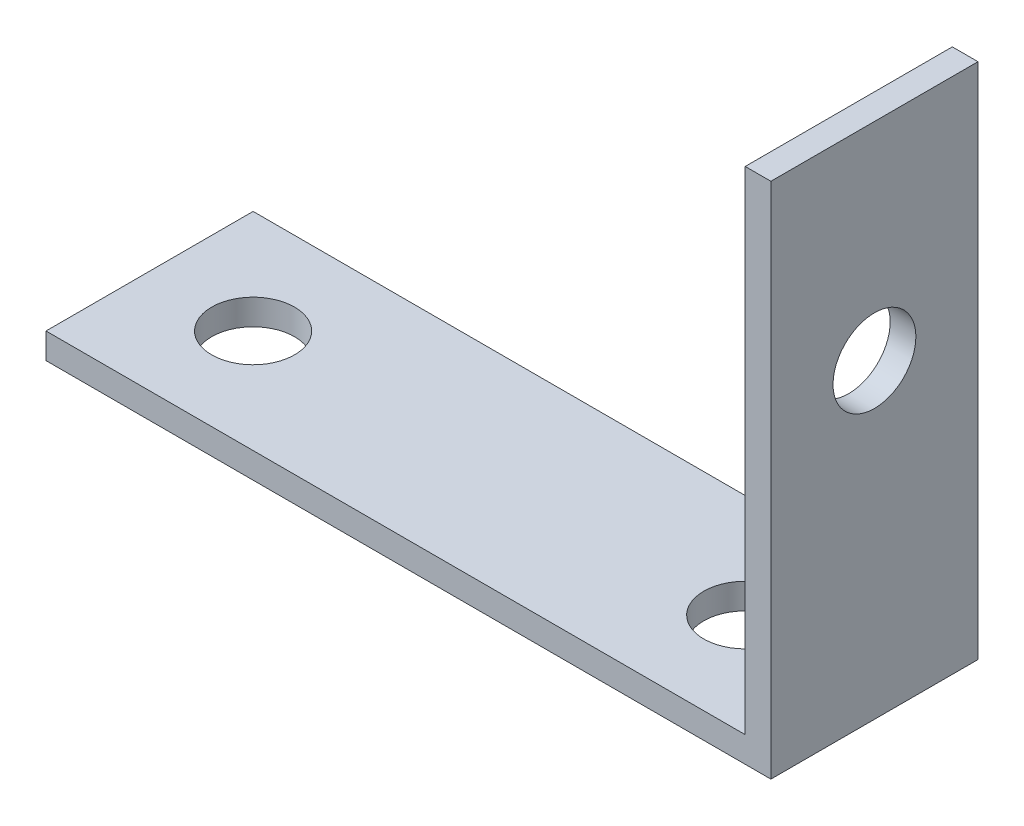
ISO-10303-21;
HEADER;
FILE_DESCRIPTION(('STEP AP214'),'2;1');
FILE_NAME('part.step','',(''),(''),'','','');
FILE_SCHEMA(('AUTOMOTIVE_DESIGN { 1 0 10303 214 1 1 1 1 }'));
ENDSEC;
DATA;
#1=APPLICATION_CONTEXT('core data for automotive mechanical design processes');
#2=APPLICATION_PROTOCOL_DEFINITION('international standard','automotive_design',2000,#1);
#3=PRODUCT_CONTEXT('',#1,'mechanical');
#4=PRODUCT('Part','Part','',(#3));
#5=PRODUCT_RELATED_PRODUCT_CATEGORY('part','',(#4));
#6=PRODUCT_DEFINITION_FORMATION('','',#4);
#7=PRODUCT_DEFINITION_CONTEXT('part definition',#1,'design');
#8=PRODUCT_DEFINITION('design','',#6,#7);
#9=PRODUCT_DEFINITION_SHAPE('','',#8);
#10=(LENGTH_UNIT() NAMED_UNIT(*) SI_UNIT(.MILLI.,.METRE.));
#11=(NAMED_UNIT(*) PLANE_ANGLE_UNIT() SI_UNIT($,.RADIAN.));
#12=(NAMED_UNIT(*) SI_UNIT($,.STERADIAN.) SOLID_ANGLE_UNIT());
#13=UNCERTAINTY_MEASURE_WITH_UNIT(LENGTH_MEASURE(1.E-05),#10,'distance_accuracy_value','');
#14=(GEOMETRIC_REPRESENTATION_CONTEXT(3) GLOBAL_UNCERTAINTY_ASSIGNED_CONTEXT((#13)) GLOBAL_UNIT_ASSIGNED_CONTEXT((#10,
#11,#12)) REPRESENTATION_CONTEXT('',''));
#15=CARTESIAN_POINT('',(0.,0.,0.));
#16=DIRECTION('',(0.,0.,1.));
#17=DIRECTION('',(1.,0.,0.));
#18=AXIS2_PLACEMENT_3D('',#15,#16,#17);
#19=CARTESIAN_POINT('',(0.,1.5748,12.7));
#20=DIRECTION('',(1.,0.,0.));
#21=DIRECTION('',(0.,1.,0.));
#22=AXIS2_PLACEMENT_3D('',#19,#20,#21);
#23=PLANE('',#22);
#24=DIRECTION('',(0.,-1.,0.));
#25=VECTOR('',#24,1.);
#26=CARTESIAN_POINT('',(0.,1.5748,0.));
#27=LINE('',#26,#25);
#28=CARTESIAN_POINT('',(0.,1.5748,0.));
#29=VERTEX_POINT('',#28);
#30=CARTESIAN_POINT('',(0.,0.,0.));
#31=VERTEX_POINT('',#30);
#32=EDGE_CURVE('E116',#29,#31,#27,.T.);
#33=ORIENTED_EDGE('',*,*,#32,.T.);
#34=DIRECTION('',(0.,0.,-1.));
#35=VECTOR('',#34,1.);
#36=CARTESIAN_POINT('',(0.,0.,12.7));
#37=LINE('',#36,#35);
#38=CARTESIAN_POINT('',(0.,0.,12.7));
#39=VERTEX_POINT('',#38);
#40=EDGE_CURVE('E11',#39,#31,#37,.T.);
#41=ORIENTED_EDGE('',*,*,#40,.F.);
#42=DIRECTION('',(0.,-1.,0.));
#43=VECTOR('',#42,1.);
#44=CARTESIAN_POINT('',(0.,1.5748,12.7));
#45=LINE('',#44,#43);
#46=CARTESIAN_POINT('',(0.,1.5748,12.7));
#47=VERTEX_POINT('',#46);
#48=EDGE_CURVE('E127',#47,#39,#45,.T.);
#49=ORIENTED_EDGE('',*,*,#48,.F.);
#50=DIRECTION('',(0.,0.,-1.));
#51=VECTOR('',#50,1.);
#52=CARTESIAN_POINT('',(0.,1.5748,12.7));
#53=LINE('',#52,#51);
#54=EDGE_CURVE('E112',#47,#29,#53,.T.);
#55=ORIENTED_EDGE('',*,*,#54,.T.);
#56=EDGE_LOOP('',(#33,#41,#49,#55));
#57=FACE_BOUND('',#56,.T.);
#58=ADVANCED_FACE('F32',(#57),#23,.F.);
#59=CARTESIAN_POINT('',(0.,0.,12.7));
#60=DIRECTION('',(0.,1.,0.));
#61=DIRECTION('',(0.,0.,1.));
#62=AXIS2_PLACEMENT_3D('',#59,#60,#61);
#63=PLANE('',#62);
#64=CARTESIAN_POINT('',(6.35,0.,6.35));
#65=DIRECTION('',(0.,1.,0.));
#66=DIRECTION('',(-1.,0.,0.));
#67=AXIS2_PLACEMENT_3D('',#64,#65,#66);
#68=CIRCLE('',#67,2.54);
#69=CARTESIAN_POINT('',(3.81,0.,6.35));
#70=VERTEX_POINT('',#69);
#71=EDGE_CURVE('E237',#70,#70,#68,.T.);
#72=ORIENTED_EDGE('',*,*,#71,.T.);
#73=EDGE_LOOP('',(#72));
#74=FACE_BOUND('',#73,.T.);
#75=CARTESIAN_POINT('',(36.5252,0.,6.35));
#76=DIRECTION('',(0.,1.,0.));
#77=DIRECTION('',(-1.,0.,0.));
#78=AXIS2_PLACEMENT_3D('',#75,#76,#77);
#79=CIRCLE('',#78,2.54000000000001);
#80=CARTESIAN_POINT('',(33.9852,0.,6.35));
#81=VERTEX_POINT('',#80);
#82=EDGE_CURVE('E244',#81,#81,#79,.T.);
#83=ORIENTED_EDGE('',*,*,#82,.T.);
#84=EDGE_LOOP('',(#83));
#85=FACE_BOUND('',#84,.T.);
#86=DIRECTION('',(1.,0.,0.));
#87=VECTOR('',#86,1.);
#88=CARTESIAN_POINT('',(0.,0.,0.));
#89=LINE('',#88,#87);
#90=CARTESIAN_POINT('',(44.45,0.,0.));
#91=VERTEX_POINT('',#90);
#92=EDGE_CURVE('E119',#31,#91,#89,.T.);
#93=ORIENTED_EDGE('',*,*,#92,.T.);
#94=DIRECTION('',(0.,0.,-1.));
#95=VECTOR('',#94,1.);
#96=CARTESIAN_POINT('',(44.45,0.,12.7));
#97=LINE('',#96,#95);
#98=CARTESIAN_POINT('',(44.45,0.,12.7));
#99=VERTEX_POINT('',#98);
#100=EDGE_CURVE('E40',#99,#91,#97,.T.);
#101=ORIENTED_EDGE('',*,*,#100,.F.);
#102=DIRECTION('',(1.,0.,0.));
#103=VECTOR('',#102,1.);
#104=CARTESIAN_POINT('',(0.,0.,12.7));
#105=LINE('',#104,#103);
#106=EDGE_CURVE('E85',#39,#99,#105,.T.);
#107=ORIENTED_EDGE('',*,*,#106,.F.);
#108=ORIENTED_EDGE('',*,*,#40,.T.);
#109=EDGE_LOOP('',(#93,#101,#107,#108));
#110=FACE_BOUND('',#109,.T.);
#111=ADVANCED_FACE('F155',(#74,#85,#110),#63,.F.);
#112=CARTESIAN_POINT('',(44.45,0.,12.7));
#113=DIRECTION('',(-1.,0.,0.));
#114=DIRECTION('',(0.,0.,1.));
#115=AXIS2_PLACEMENT_3D('',#112,#113,#114);
#116=PLANE('',#115);
#117=CARTESIAN_POINT('',(44.45,19.05,6.35));
#118=DIRECTION('',(-1.,0.,0.));
#119=DIRECTION('',(0.,-1.,0.));
#120=AXIS2_PLACEMENT_3D('',#117,#118,#119);
#121=CIRCLE('',#120,2.54);
#122=CARTESIAN_POINT('',(44.45,16.51,6.35));
#123=VERTEX_POINT('',#122);
#124=EDGE_CURVE('E120',#123,#123,#121,.T.);
#125=ORIENTED_EDGE('',*,*,#124,.T.);
#126=EDGE_LOOP('',(#125));
#127=FACE_BOUND('',#126,.T.);
#128=DIRECTION('',(0.,1.,0.));
#129=VECTOR('',#128,1.);
#130=CARTESIAN_POINT('',(44.45,0.,0.));
#131=LINE('',#130,#129);
#132=CARTESIAN_POINT('',(44.45,31.75,0.));
#133=VERTEX_POINT('',#132);
#134=EDGE_CURVE('E122',#91,#133,#131,.T.);
#135=ORIENTED_EDGE('',*,*,#134,.T.);
#136=DIRECTION('',(0.,0.,-1.));
#137=VECTOR('',#136,1.);
#138=CARTESIAN_POINT('',(44.45,31.75,12.7));
#139=LINE('',#138,#137);
#140=CARTESIAN_POINT('',(44.45,31.75,12.7));
#141=VERTEX_POINT('',#140);
#142=EDGE_CURVE('E107',#141,#133,#139,.T.);
#143=ORIENTED_EDGE('',*,*,#142,.F.);
#144=DIRECTION('',(0.,1.,0.));
#145=VECTOR('',#144,1.);
#146=CARTESIAN_POINT('',(44.45,0.,12.7));
#147=LINE('',#146,#145);
#148=EDGE_CURVE('E98',#99,#141,#147,.T.);
#149=ORIENTED_EDGE('',*,*,#148,.F.);
#150=ORIENTED_EDGE('',*,*,#100,.T.);
#151=EDGE_LOOP('',(#135,#143,#149,#150));
#152=FACE_BOUND('',#151,.T.);
#153=ADVANCED_FACE('F133',(#127,#152),#116,.F.);
#154=CARTESIAN_POINT('',(44.45,31.75,12.7));
#155=DIRECTION('',(0.,-1.,0.));
#156=DIRECTION('',(1.,0.,0.));
#157=AXIS2_PLACEMENT_3D('',#154,#155,#156);
#158=PLANE('',#157);
#159=DIRECTION('',(-1.,0.,0.));
#160=VECTOR('',#159,1.);
#161=CARTESIAN_POINT('',(44.45,31.75,0.));
#162=LINE('',#161,#160);
#163=CARTESIAN_POINT('',(42.8752,31.75,0.));
#164=VERTEX_POINT('',#163);
#165=EDGE_CURVE('E106',#133,#164,#162,.T.);
#166=ORIENTED_EDGE('',*,*,#165,.T.);
#167=DIRECTION('',(0.,0.,-1.));
#168=VECTOR('',#167,1.);
#169=CARTESIAN_POINT('',(42.8752,31.75,12.7));
#170=LINE('',#169,#168);
#171=CARTESIAN_POINT('',(42.8752,31.75,12.7));
#172=VERTEX_POINT('',#171);
#173=EDGE_CURVE('E103',#172,#164,#170,.T.);
#174=ORIENTED_EDGE('',*,*,#173,.F.);
#175=DIRECTION('',(-1.,0.,0.));
#176=VECTOR('',#175,1.);
#177=CARTESIAN_POINT('',(44.45,31.75,12.7));
#178=LINE('',#177,#176);
#179=EDGE_CURVE('E92',#141,#172,#178,.T.);
#180=ORIENTED_EDGE('',*,*,#179,.F.);
#181=ORIENTED_EDGE('',*,*,#142,.T.);
#182=EDGE_LOOP('',(#166,#174,#180,#181));
#183=FACE_BOUND('',#182,.T.);
#184=ADVANCED_FACE('F104',(#183),#158,.F.);
#185=CARTESIAN_POINT('',(42.8752,31.75,12.7));
#186=DIRECTION('',(1.,0.,0.));
#187=DIRECTION('',(0.,1.,0.));
#188=AXIS2_PLACEMENT_3D('',#185,#186,#187);
#189=PLANE('',#188);
#190=CARTESIAN_POINT('',(42.8752,19.05,6.35));
#191=DIRECTION('',(-1.,0.,0.));
#192=DIRECTION('',(0.,-1.,0.));
#193=AXIS2_PLACEMENT_3D('',#190,#191,#192);
#194=CIRCLE('',#193,2.54);
#195=CARTESIAN_POINT('',(42.8752,16.51,6.35));
#196=VERTEX_POINT('',#195);
#197=EDGE_CURVE('E247',#196,#196,#194,.T.);
#198=ORIENTED_EDGE('',*,*,#197,.F.);
#199=EDGE_LOOP('',(#198));
#200=FACE_BOUND('',#199,.T.);
#201=DIRECTION('',(0.,-1.,0.));
#202=VECTOR('',#201,1.);
#203=CARTESIAN_POINT('',(42.8752,31.75,0.));
#204=LINE('',#203,#202);
#205=CARTESIAN_POINT('',(42.8752,1.57480000000001,0.));
#206=VERTEX_POINT('',#205);
#207=EDGE_CURVE('E71',#164,#206,#204,.T.);
#208=ORIENTED_EDGE('',*,*,#207,.T.);
#209=DIRECTION('',(0.,0.,-1.));
#210=VECTOR('',#209,1.);
#211=CARTESIAN_POINT('',(42.8752,1.57480000000001,12.7));
#212=LINE('',#211,#210);
#213=CARTESIAN_POINT('',(42.8752,1.57480000000001,12.7));
#214=VERTEX_POINT('',#213);
#215=EDGE_CURVE('E108',#214,#206,#212,.T.);
#216=ORIENTED_EDGE('',*,*,#215,.F.);
#217=DIRECTION('',(0.,-1.,0.));
#218=VECTOR('',#217,1.);
#219=CARTESIAN_POINT('',(42.8752,31.75,12.7));
#220=LINE('',#219,#218);
#221=EDGE_CURVE('E96',#172,#214,#220,.T.);
#222=ORIENTED_EDGE('',*,*,#221,.F.);
#223=ORIENTED_EDGE('',*,*,#173,.T.);
#224=EDGE_LOOP('',(#208,#216,#222,#223));
#225=FACE_BOUND('',#224,.T.);
#226=ADVANCED_FACE('F110',(#200,#225),#189,.F.);
#227=CARTESIAN_POINT('',(42.8752,1.57480000000001,12.7));
#228=DIRECTION('',(0.,-1.,0.));
#229=DIRECTION('',(1.,0.,0.));
#230=AXIS2_PLACEMENT_3D('',#227,#228,#229);
#231=PLANE('',#230);
#232=CARTESIAN_POINT('',(6.35,1.5748,6.35));
#233=DIRECTION('',(0.,1.,0.));
#234=DIRECTION('',(-1.,0.,0.));
#235=AXIS2_PLACEMENT_3D('',#232,#233,#234);
#236=CIRCLE('',#235,2.54);
#237=CARTESIAN_POINT('',(3.81,1.5748,6.35));
#238=VERTEX_POINT('',#237);
#239=EDGE_CURVE('E239',#238,#238,#236,.T.);
#240=ORIENTED_EDGE('',*,*,#239,.F.);
#241=EDGE_LOOP('',(#240));
#242=FACE_BOUND('',#241,.T.);
#243=CARTESIAN_POINT('',(36.5252,1.5748,6.35));
#244=DIRECTION('',(0.,1.,0.));
#245=DIRECTION('',(-1.,0.,0.));
#246=AXIS2_PLACEMENT_3D('',#243,#244,#245);
#247=CIRCLE('',#246,2.54000000000001);
#248=CARTESIAN_POINT('',(33.9852,1.5748,6.35));
#249=VERTEX_POINT('',#248);
#250=EDGE_CURVE('E241',#249,#249,#247,.T.);
#251=ORIENTED_EDGE('',*,*,#250,.F.);
#252=EDGE_LOOP('',(#251));
#253=FACE_BOUND('',#252,.T.);
#254=DIRECTION('',(-1.,0.,0.));
#255=VECTOR('',#254,1.);
#256=CARTESIAN_POINT('',(42.8752,1.57480000000001,0.));
#257=LINE('',#256,#255);
#258=EDGE_CURVE('E77',#206,#29,#257,.T.);
#259=ORIENTED_EDGE('',*,*,#258,.T.);
#260=ORIENTED_EDGE('',*,*,#54,.F.);
#261=DIRECTION('',(-1.,0.,0.));
#262=VECTOR('',#261,1.);
#263=CARTESIAN_POINT('',(42.8752,1.57480000000001,12.7));
#264=LINE('',#263,#262);
#265=EDGE_CURVE('E48',#214,#47,#264,.T.);
#266=ORIENTED_EDGE('',*,*,#265,.F.);
#267=ORIENTED_EDGE('',*,*,#215,.T.);
#268=EDGE_LOOP('',(#259,#260,#266,#267));
#269=FACE_BOUND('',#268,.T.);
#270=ADVANCED_FACE('F140',(#242,#253,#269),#231,.F.);
#271=CARTESIAN_POINT('',(0.,0.,12.7));
#272=DIRECTION('',(0.,0.,1.));
#273=DIRECTION('',(1.,0.,0.));
#274=AXIS2_PLACEMENT_3D('',#271,#272,#273);
#275=PLANE('',#274);
#276=ORIENTED_EDGE('',*,*,#48,.T.);
#277=ORIENTED_EDGE('',*,*,#106,.T.);
#278=ORIENTED_EDGE('',*,*,#148,.T.);
#279=ORIENTED_EDGE('',*,*,#179,.T.);
#280=ORIENTED_EDGE('',*,*,#221,.T.);
#281=ORIENTED_EDGE('',*,*,#265,.T.);
#282=EDGE_LOOP('',(#276,#277,#278,#279,#280,#281));
#283=FACE_BOUND('',#282,.T.);
#284=ADVANCED_FACE('F94',(#283),#275,.T.);
#285=CARTESIAN_POINT('',(0.,0.,0.));
#286=DIRECTION('',(0.,0.,1.));
#287=DIRECTION('',(1.,0.,0.));
#288=AXIS2_PLACEMENT_3D('',#285,#286,#287);
#289=PLANE('',#288);
#290=ORIENTED_EDGE('',*,*,#32,.F.);
#291=ORIENTED_EDGE('',*,*,#258,.F.);
#292=ORIENTED_EDGE('',*,*,#207,.F.);
#293=ORIENTED_EDGE('',*,*,#165,.F.);
#294=ORIENTED_EDGE('',*,*,#134,.F.);
#295=ORIENTED_EDGE('',*,*,#92,.F.);
#296=EDGE_LOOP('',(#290,#291,#292,#293,#294,#295));
#297=FACE_BOUND('',#296,.T.);
#298=ADVANCED_FACE('F136',(#297),#289,.F.);
#299=CARTESIAN_POINT('',(44.45,19.05,6.35));
#300=DIRECTION('',(-1.,0.,0.));
#301=DIRECTION('',(0.,-1.,0.));
#302=AXIS2_PLACEMENT_3D('',#299,#300,#301);
#303=CYLINDRICAL_SURFACE('',#302,2.54);
#304=ORIENTED_EDGE('',*,*,#124,.F.);
#305=EDGE_LOOP('',(#304));
#306=FACE_BOUND('',#305,.T.);
#307=ORIENTED_EDGE('',*,*,#197,.T.);
#308=EDGE_LOOP('',(#307));
#309=FACE_BOUND('',#308,.T.);
#310=ADVANCED_FACE('F187',(#306,#309),#303,.F.);
#311=CARTESIAN_POINT('',(36.5252,0.,6.35));
#312=DIRECTION('',(0.,1.,0.));
#313=DIRECTION('',(-1.,0.,0.));
#314=AXIS2_PLACEMENT_3D('',#311,#312,#313);
#315=CYLINDRICAL_SURFACE('',#314,2.54000000000001);
#316=ORIENTED_EDGE('',*,*,#82,.F.);
#317=EDGE_LOOP('',(#316));
#318=FACE_BOUND('',#317,.T.);
#319=ORIENTED_EDGE('',*,*,#250,.T.);
#320=EDGE_LOOP('',(#319));
#321=FACE_BOUND('',#320,.T.);
#322=ADVANCED_FACE('F191',(#318,#321),#315,.F.);
#323=CARTESIAN_POINT('',(6.35,0.,6.35));
#324=DIRECTION('',(0.,1.,0.));
#325=DIRECTION('',(-1.,0.,0.));
#326=AXIS2_PLACEMENT_3D('',#323,#324,#325);
#327=CYLINDRICAL_SURFACE('',#326,2.54);
#328=ORIENTED_EDGE('',*,*,#71,.F.);
#329=EDGE_LOOP('',(#328));
#330=FACE_BOUND('',#329,.T.);
#331=ORIENTED_EDGE('',*,*,#239,.T.);
#332=EDGE_LOOP('',(#331));
#333=FACE_BOUND('',#332,.T.);
#334=ADVANCED_FACE('F213',(#330,#333),#327,.F.);
#335=CLOSED_SHELL('',(#58,#111,#153,#184,#226,#270,#284,#298,#310,#322,#334));
#336=MANIFOLD_SOLID_BREP('B2',#335);
#337=ADVANCED_BREP_SHAPE_REPRESENTATION('',(#18,#336),#14);
#338=SHAPE_DEFINITION_REPRESENTATION(#9,#337);
ENDSEC;
END-ISO-10303-21;
